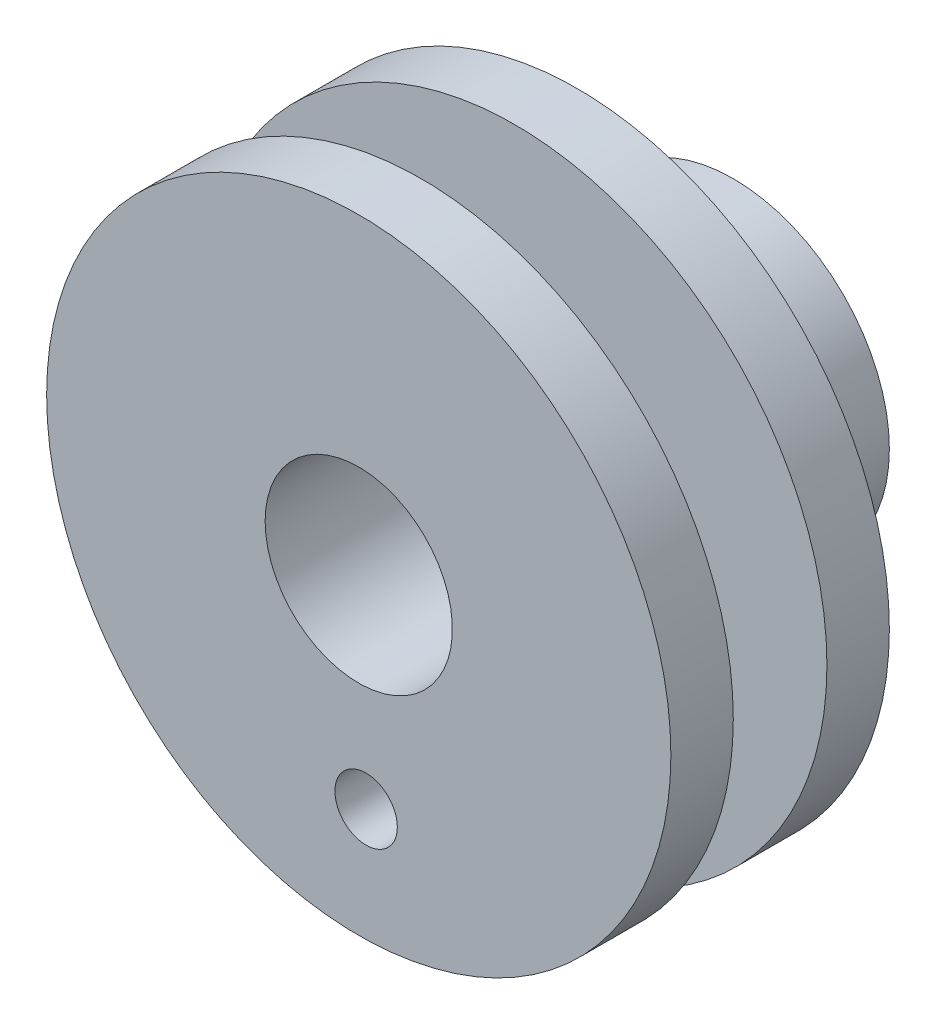
ISO-10303-21;
HEADER;
FILE_DESCRIPTION(('STEP AP214'),'2;1');
FILE_NAME('part.step','',(''),(''),'','','');
FILE_SCHEMA(('AUTOMOTIVE_DESIGN { 1 0 10303 214 1 1 1 1 }'));
ENDSEC;
DATA;
#1=APPLICATION_CONTEXT('core data for automotive mechanical design processes');
#2=APPLICATION_PROTOCOL_DEFINITION('international standard','automotive_design',2000,#1);
#3=PRODUCT_CONTEXT('',#1,'mechanical');
#4=PRODUCT('Part','Part','',(#3));
#5=PRODUCT_RELATED_PRODUCT_CATEGORY('part','',(#4));
#6=PRODUCT_DEFINITION_FORMATION('','',#4);
#7=PRODUCT_DEFINITION_CONTEXT('part definition',#1,'design');
#8=PRODUCT_DEFINITION('design','',#6,#7);
#9=PRODUCT_DEFINITION_SHAPE('','',#8);
#10=(LENGTH_UNIT() NAMED_UNIT(*) SI_UNIT(.MILLI.,.METRE.));
#11=(NAMED_UNIT(*) PLANE_ANGLE_UNIT() SI_UNIT($,.RADIAN.));
#12=(NAMED_UNIT(*) SI_UNIT($,.STERADIAN.) SOLID_ANGLE_UNIT());
#13=UNCERTAINTY_MEASURE_WITH_UNIT(LENGTH_MEASURE(1.E-05),#10,'distance_accuracy_value','');
#14=(GEOMETRIC_REPRESENTATION_CONTEXT(3) GLOBAL_UNCERTAINTY_ASSIGNED_CONTEXT((#13)) GLOBAL_UNIT_ASSIGNED_CONTEXT((#10,
#11,#12)) REPRESENTATION_CONTEXT('',''));
#15=CARTESIAN_POINT('',(0.,0.,0.));
#16=DIRECTION('',(0.,0.,1.));
#17=DIRECTION('',(1.,0.,0.));
#18=AXIS2_PLACEMENT_3D('',#15,#16,#17);
#19=CARTESIAN_POINT('',(0.,0.,0.));
#20=DIRECTION('',(0.,0.,1.));
#21=DIRECTION('',(1.,0.,0.));
#22=AXIS2_PLACEMENT_3D('',#19,#20,#21);
#23=PLANE('',#22);
#24=CARTESIAN_POINT('',(0.,0.,0.));
#25=DIRECTION('',(0.,0.,1.));
#26=DIRECTION('',(1.,0.,0.));
#27=AXIS2_PLACEMENT_3D('',#24,#25,#26);
#28=CIRCLE('',#27,5.);
#29=CARTESIAN_POINT('',(5.,0.,0.));
#30=VERTEX_POINT('',#29);
#31=EDGE_CURVE('E44',#30,#30,#28,.T.);
#32=ORIENTED_EDGE('',*,*,#31,.F.);
#33=EDGE_LOOP('',(#32));
#34=FACE_BOUND('',#33,.T.);
#35=CARTESIAN_POINT('',(0.,0.,0.));
#36=DIRECTION('',(0.,0.,1.));
#37=DIRECTION('',(1.,0.,0.));
#38=AXIS2_PLACEMENT_3D('',#35,#36,#37);
#39=CIRCLE('',#38,3.);
#40=CARTESIAN_POINT('',(3.,0.,0.));
#41=VERTEX_POINT('',#40);
#42=EDGE_CURVE('E49',#41,#41,#39,.T.);
#43=ORIENTED_EDGE('',*,*,#42,.T.);
#44=EDGE_LOOP('',(#43));
#45=FACE_BOUND('',#44,.T.);
#46=ADVANCED_FACE('F35',(#34,#45),#23,.F.);
#47=CARTESIAN_POINT('',(0.,0.,5.));
#48=DIRECTION('',(0.,0.,-1.));
#49=DIRECTION('',(-1.,0.,0.));
#50=AXIS2_PLACEMENT_3D('',#47,#48,#49);
#51=CYLINDRICAL_SURFACE('',#50,5.);
#52=CARTESIAN_POINT('',(1.49167878903844,-4.77230493475981,2.14391534473121));
#53=CARTESIAN_POINT('',(1.49167689702003,-4.77230634928233,2.0748899692689));
#54=CARTESIAN_POINT('',(1.48602414465484,-4.77408365845577,2.00584289539221));
#55=CARTESIAN_POINT('',(1.46359214324519,-4.78100732743095,1.86973155564419));
#56=CARTESIAN_POINT('',(1.44680641865099,-4.7861556479763,1.80266846749705));
#57=CARTESIAN_POINT('',(1.40266716991747,-4.79927602091638,1.67251357563769));
#58=CARTESIAN_POINT('',(1.37532728809784,-4.80724442696224,1.60941676703837));
#59=CARTESIAN_POINT('',(1.31086972752744,-4.82521868449436,1.48875991846125));
#60=CARTESIAN_POINT('',(1.27375163365594,-4.83522462247718,1.4312001136911));
#61=CARTESIAN_POINT('',(1.18988485361615,-4.85655002347249,1.32198452210011));
#62=CARTESIAN_POINT('',(1.14295969064206,-4.8678916100804,1.27046854455619));
#63=CARTESIAN_POINT('',(1.04114859757223,-4.89067749535809,1.17603464755104));
#64=CARTESIAN_POINT('',(0.986261924052269,-4.90212180352601,1.13311753192034));
#65=CARTESIAN_POINT('',(0.86909988669708,-4.92425255712707,1.05652761091557));
#66=CARTESIAN_POINT('',(0.806732111969398,-4.93492619965248,1.02299215065048));
#67=CARTESIAN_POINT('',(0.676930882811401,-4.95439855590894,0.967010522654672));
#68=CARTESIAN_POINT('',(0.609498177480725,-4.96319754616409,0.944562718773456));
#69=CARTESIAN_POINT('',(0.472909352860754,-4.97804965819187,0.911841427441921));
#70=CARTESIAN_POINT('',(0.403815820916356,-4.98415479528959,0.901330522567923));
#71=CARTESIAN_POINT('',(0.264656522202342,-4.99347742520208,0.892036155093437));
#72=CARTESIAN_POINT('',(0.194590900704426,-4.99669534486935,0.893250958626414));
#73=CARTESIAN_POINT('',(0.0571242382784611,-5.00013623795704,0.907202769856286));
#74=CARTESIAN_POINT('',(-0.0103014298681106,-5.00042408336881,0.919683507258142));
#75=CARTESIAN_POINT('',(-0.142196625302667,-4.99841306622039,0.955400979755463));
#76=CARTESIAN_POINT('',(-0.206665995026979,-4.99611406595386,0.978638287419918));
#77=CARTESIAN_POINT('',(-0.331474384505906,-4.98939570164436,1.03541663007475));
#78=CARTESIAN_POINT('',(-0.391770821311243,-4.98495736679415,1.06904886706209));
#79=CARTESIAN_POINT('',(-0.506021467415015,-4.97465954395289,1.14559318428934));
#80=CARTESIAN_POINT('',(-0.559974570785725,-4.96879980869184,1.18850687901152));
#81=CARTESIAN_POINT('',(-0.661512486549662,-4.9563183996494,1.2837697157224));
#82=CARTESIAN_POINT('',(-0.708885422728341,-4.94968039648488,1.3363427909051));
#83=CARTESIAN_POINT('',(-0.794167952806289,-4.93671584037692,1.44871533150134));
#84=CARTESIAN_POINT('',(-0.832077104396616,-4.93038930200152,1.50851513447671));
#85=CARTESIAN_POINT('',(-0.897457778463843,-4.91891063079233,1.63406036180569));
#86=CARTESIAN_POINT('',(-0.924877798591494,-4.9137643412839,1.69983320988781));
#87=CARTESIAN_POINT('',(-0.968096049289099,-4.9054336923531,1.83520807876944));
#88=CARTESIAN_POINT('',(-0.983896766843379,-4.90224891311469,1.90480927672278));
#89=CARTESIAN_POINT('',(-1.00305318962098,-4.8983648378151,2.04389509549277));
#90=CARTESIAN_POINT('',(-1.00672657194741,-4.89760211647129,2.11333424139602));
#91=CARTESIAN_POINT('',(-1.00238965822174,-4.8984915946074,2.25182631302029));
#92=CARTESIAN_POINT('',(-0.994380437694156,-4.90014357178523,2.32087927370683));
#93=CARTESIAN_POINT('',(-0.967193227169785,-4.90558072295166,2.45547247720856));
#94=CARTESIAN_POINT('',(-0.948200119472121,-4.90933055232822,2.52105170801663));
#95=CARTESIAN_POINT('',(-0.899808815165707,-4.91842926272917,2.64813107365705));
#96=CARTESIAN_POINT('',(-0.870409385981234,-4.92377833316385,2.70963072425887));
#97=CARTESIAN_POINT('',(-0.801403886909326,-4.93548333614744,2.82813598366488));
#98=CARTESIAN_POINT('',(-0.761608905212399,-4.94185696200594,2.88502976475275));
#99=CARTESIAN_POINT('',(-0.673217855554666,-4.95467132655259,2.99150952613188));
#100=CARTESIAN_POINT('',(-0.624620341258954,-4.96111207610561,3.04109430305624));
#101=CARTESIAN_POINT('',(-0.518588181440236,-4.97332679760415,3.13282086601668));
#102=CARTESIAN_POINT('',(-0.460962845002641,-4.97908005363381,3.17474537600561));
#103=CARTESIAN_POINT('',(-0.339382225660624,-4.9888408815225,3.24838327820682));
#104=CARTESIAN_POINT('',(-0.275427273156459,-4.99284854444099,3.2800972030353));
#105=CARTESIAN_POINT('',(-0.143475163510295,-4.99837365535276,3.33213836199517));
#106=CARTESIAN_POINT('',(-0.0755111313816414,-4.9999091703039,3.35254748692073));
#107=CARTESIAN_POINT('',(0.0628819375382873,-5.00008285499552,3.38164551203541));
#108=CARTESIAN_POINT('',(0.133310495917419,-4.99872158402299,3.39033667410073));
#109=CARTESIAN_POINT('',(0.272584438206461,-4.99303766191703,3.39562483170062));
#110=CARTESIAN_POINT('',(0.341421139895626,-4.9887960771768,3.39254248110044));
#111=CARTESIAN_POINT('',(0.477423567921002,-4.97762220346026,3.37510556061329));
#112=CARTESIAN_POINT('',(0.544589343891134,-4.97068999450925,3.36075132596482));
#113=CARTESIAN_POINT('',(0.675023740793093,-4.95465856376347,3.32135007001754));
#114=CARTESIAN_POINT('',(0.738311395086077,-4.94557120873107,3.29636102808792));
#115=CARTESIAN_POINT('',(0.859745255100065,-4.92591373250152,3.23645212095704));
#116=CARTESIAN_POINT('',(0.917890811487363,-4.91534342447474,3.20153100389424));
#117=CARTESIAN_POINT('',(1.02892737487265,-4.89332115933659,3.12177130223486));
#118=CARTESIAN_POINT('',(1.08165912540563,-4.88185414719778,3.07671516609698));
#119=CARTESIAN_POINT('',(1.17892293339561,-4.85928381293484,2.97838677976395));
#120=CARTESIAN_POINT('',(1.22345290877097,-4.8481805837462,2.92511244960882));
#121=CARTESIAN_POINT('',(1.30390112598863,-4.82717379434891,2.81066357697954));
#122=CARTESIAN_POINT('',(1.33964320950543,-4.81729647949772,2.74936019046542));
#123=CARTESIAN_POINT('',(1.40036358367896,-4.79999850349553,2.62134598232783));
#124=CARTESIAN_POINT('',(1.42534970564203,-4.79257605589608,2.55463913709778));
#125=CARTESIAN_POINT('',(1.46015783867623,-4.78207078392782,2.43069407994781));
#126=CARTESIAN_POINT('',(1.47195324942532,-4.77843293162581,2.37404888925138));
#127=CARTESIAN_POINT('',(1.48771418335974,-4.77354951642787,2.25957925848125));
#128=CARTESIAN_POINT('',(1.49168037444873,-4.77230374946555,2.20175491942488));
#129=CARTESIAN_POINT('',(1.49167878903844,-4.77230493475981,2.14391534473121));
#130=B_SPLINE_CURVE_WITH_KNOTS('',3,(#52,#53,#54,#55,#56,#57,#58,#59,#60,#61,#62,#63,#64,#65,
#66,#67,#68,#69,#70,#71,#72,#73,#74,#75,#76,#77,#78,#79,#80,#81,#82,#83,#84,#85,#86,#87,#88,#89,
#90,#91,#92,#93,#94,#95,#96,#97,#98,#99,#100,#101,#102,#103,#104,#105,#106,#107,#108,#109,#110,
#111,#112,#113,#114,#115,#116,#117,#118,#119,#120,#121,#122,#123,#124,#125,#126,#127,#128,#129),
.UNSPECIFIED.,.T.,.F.,(4,2,2,2,2,2,2,2,2,2,2,2,2,2,2,2,2,2,2,2,2,2,2,2,2,2,2,2,2,2,2,2,2,2,2,2,
2,2,4),(0.,0.206863720868067,0.413847870714331,0.620565363583007,0.827291633777388,
1.03811977096488,1.24896760739933,1.46275748198959,1.67651579923545,1.88594375497672,
2.09534074333009,2.30009131344472,2.50485278362392,2.71146437127221,2.91811192734455,
3.13035233285954,3.34260265599899,3.55588216004199,3.76911600064772,3.97671787380856,
4.18430063591899,4.38848702504601,4.59269760710706,4.80091422929576,5.00916509442519,
5.22262665482657,5.43607707859774,5.64796036403461,5.85980274454516,6.06591723063725,
6.27202558688487,6.47702438279852,6.68204902869032,6.89198548291032,7.10197515782751,
7.31588238642335,7.52963360683306,7.70298913588661,7.87632987549756),.UNSPECIFIED.);
#131=CARTESIAN_POINT('',(1.49167878903844,-4.77230493475981,2.14391534473121));
#132=VERTEX_POINT('',#131);
#133=EDGE_CURVE('E74',#132,#132,#130,.T.);
#134=ORIENTED_EDGE('',*,*,#133,.T.);
#135=EDGE_LOOP('',(#134));
#136=FACE_BOUND('',#135,.T.);
#137=CARTESIAN_POINT('',(0.,0.,5.));
#138=DIRECTION('',(0.,0.,1.));
#139=DIRECTION('',(1.,0.,0.));
#140=AXIS2_PLACEMENT_3D('',#137,#138,#139);
#141=CIRCLE('',#140,5.);
#142=CARTESIAN_POINT('',(5.,0.,5.));
#143=VERTEX_POINT('',#142);
#144=EDGE_CURVE('E10',#143,#143,#141,.T.);
#145=ORIENTED_EDGE('',*,*,#144,.F.);
#146=EDGE_LOOP('',(#145));
#147=FACE_BOUND('',#146,.T.);
#148=ORIENTED_EDGE('',*,*,#31,.T.);
#149=EDGE_LOOP('',(#148));
#150=FACE_BOUND('',#149,.T.);
#151=ADVANCED_FACE('F37',(#136,#147,#150),#51,.T.);
#152=CARTESIAN_POINT('',(0.,0.,5.));
#153=DIRECTION('',(0.,0.,-1.));
#154=DIRECTION('',(-1.,0.,0.));
#155=AXIS2_PLACEMENT_3D('',#152,#153,#154);
#156=CYLINDRICAL_SURFACE('',#155,3.);
#157=CARTESIAN_POINT('',(1.38545383099857,-2.66092421578883,2.14391534473121));
#158=CARTESIAN_POINT('',(1.38544679114328,-2.66093174600651,2.07724345383435));
#159=CARTESIAN_POINT('',(1.38021729183885,-2.66367137359121,2.01046268790499));
#160=CARTESIAN_POINT('',(1.3594902208194,-2.67430602366312,1.87882840267407));
#161=CARTESIAN_POINT('',(1.34396476533493,-2.68221504519329,1.81398061805597));
#162=CARTESIAN_POINT('',(1.30332367199318,-2.70219429759885,1.68835421504013));
#163=CARTESIAN_POINT('',(1.27824712675196,-2.71424754683967,1.62756018101619));
#164=CARTESIAN_POINT('',(1.21928587266197,-2.7412385840525,1.51115589515316));
#165=CARTESIAN_POINT('',(1.18540324740859,-2.75617568946427,1.45554442129809));
#166=CARTESIAN_POINT('',(1.10748348781613,-2.78843208523749,1.34758961975774));
#167=CARTESIAN_POINT('',(1.06298123757245,-2.80583823640156,1.29560778598712));
#168=CARTESIAN_POINT('',(0.965978526329279,-2.84069364388933,1.19971512223366));
#169=CARTESIAN_POINT('',(0.913474995731533,-2.85814291421687,1.1558074041182));
#170=CARTESIAN_POINT('',(0.799100323430222,-2.89225634984006,1.07546581385193));
#171=CARTESIAN_POINT('',(0.73692164578405,-2.90885363447924,1.03943871669886));
#172=CARTESIAN_POINT('',(0.606564394243463,-2.93879933656774,0.978639324225608));
#173=CARTESIAN_POINT('',(0.538388499856499,-2.95214919500254,0.953862032766995));
#174=CARTESIAN_POINT('',(0.401698126834175,-2.97374743052062,0.917575885974473));
#175=CARTESIAN_POINT('',(0.333385894110534,-2.98222513244724,0.905443649829167));
#176=CARTESIAN_POINT('',(0.195287724652109,-2.99443816831912,0.892777703571356));
#177=CARTESIAN_POINT('',(0.125502397185949,-2.99817542529125,0.892239288848252));
#178=CARTESIAN_POINT('',(-0.00902791885301256,-3.00069534784421,0.902449625664532));
#179=CARTESIAN_POINT('',(-0.0738211851174021,-2.99976570297799,0.91251344525694));
#180=CARTESIAN_POINT('',(-0.200899753447096,-2.99394169783605,0.942468447369375));
#181=CARTESIAN_POINT('',(-0.263184870259452,-2.98904704526498,0.962360354361377));
#182=CARTESIAN_POINT('',(-0.384594446786624,-2.97588236943789,1.01164338562585));
#183=CARTESIAN_POINT('',(-0.443656186723513,-2.96756198805153,1.04117480760204));
#184=CARTESIAN_POINT('',(-0.556259212355057,-2.94853209490002,1.10876110143155));
#185=CARTESIAN_POINT('',(-0.609798537263984,-2.93782173879235,1.1468189855762));
#186=CARTESIAN_POINT('',(-0.71380416466175,-2.91436496174055,1.23349776513583));
#187=CARTESIAN_POINT('',(-0.763787837116665,-2.90152823740883,1.28267413601022));
#188=CARTESIAN_POINT('',(-0.855002118278728,-2.87597287343849,1.38862678543779));
#189=CARTESIAN_POINT('',(-0.896229349232412,-2.86325428117125,1.4454059830233));
#190=CARTESIAN_POINT('',(-0.969968535097738,-2.83914059427698,1.56731038139312));
#191=CARTESIAN_POINT('',(-1.00214952124901,-2.82780273599979,1.63264855047449));
#192=CARTESIAN_POINT('',(-1.05467050317575,-2.80864041459464,1.76839638970571));
#193=CARTESIAN_POINT('',(-1.07501896554427,-2.80081344022296,1.83880239300075));
#194=CARTESIAN_POINT('',(-1.10198733109501,-2.79030847476632,1.97781215364521));
#195=CARTESIAN_POINT('',(-1.10941229667032,-2.78732936142461,2.04623646699026));
#196=CARTESIAN_POINT('',(-1.11267182795017,-2.7860306791078,2.18339382714271));
#197=CARTESIAN_POINT('',(-1.10851040349725,-2.78770949810486,2.25212675892292));
#198=CARTESIAN_POINT('',(-1.08946002536754,-2.79520438657093,2.38331373016165));
#199=CARTESIAN_POINT('',(-1.0752749339499,-2.80074869693281,2.44588803151801));
#200=CARTESIAN_POINT('',(-1.03753832000012,-2.81494539704105,2.56776664122908));
#201=CARTESIAN_POINT('',(-1.01398460815321,-2.82359851322584,2.62707018156191));
#202=CARTESIAN_POINT('',(-0.957111998901429,-2.84339181559625,2.74353065508767));
#203=CARTESIAN_POINT('',(-0.92342179228409,-2.85462180912228,2.80049031934153));
#204=CARTESIAN_POINT('',(-0.847658951466137,-2.87802792704141,2.90832339723022));
#205=CARTESIAN_POINT('',(-0.805582689353646,-2.89020445952353,2.95919416143307));
#206=CARTESIAN_POINT('',(-0.710263425331896,-2.91515726072067,3.05771547961521));
#207=CARTESIAN_POINT('',(-0.656390210351152,-2.92790165518948,3.10476674468186));
#208=CARTESIAN_POINT('',(-0.541238021485154,-2.95135736426589,3.18938763671053));
#209=CARTESIAN_POINT('',(-0.479958505342897,-2.96206852986159,3.2269565687949));
#210=CARTESIAN_POINT('',(-0.35135902996874,-2.98006165676206,3.29150522017478));
#211=CARTESIAN_POINT('',(-0.284024009413148,-2.98733476947777,3.31845758602068));
#212=CARTESIAN_POINT('',(-0.145438113173097,-2.9972756857411,3.36053213706563));
#213=CARTESIAN_POINT('',(-0.0741895950802496,-2.99994623126639,3.37566136295727));
#214=CARTESIAN_POINT('',(0.0648090947821733,-3.0000484909428,3.39277347025151));
#215=CARTESIAN_POINT('',(0.132455688866621,-2.99783334440976,3.39560134442816));
#216=CARTESIAN_POINT('',(0.267005383324585,-2.98885445877756,3.39030220343726));
#217=CARTESIAN_POINT('',(0.333908611963188,-2.98209151717432,3.38217710871833));
#218=CARTESIAN_POINT('',(0.462643476192199,-2.96479924912555,3.35580927257254));
#219=CARTESIAN_POINT('',(0.524570829988508,-2.95441203997156,3.33793566426165));
#220=CARTESIAN_POINT('',(0.644361339532228,-2.93061961539624,3.29298109752207));
#221=CARTESIAN_POINT('',(0.702223720723897,-2.91721382683834,3.2658983900663));
#222=CARTESIAN_POINT('',(0.815155184405698,-2.88774681780898,3.20192581551674));
#223=CARTESIAN_POINT('',(0.869979846365487,-2.87159296968466,3.16464804330721));
#224=CARTESIAN_POINT('',(0.972769971033962,-2.83842218918463,3.08190816185931));
#225=CARTESIAN_POINT('',(1.02073287547964,-2.82140493809369,3.03644301432445));
#226=CARTESIAN_POINT('',(1.11188293158216,-2.78679979041306,2.9349705188768));
#227=CARTESIAN_POINT('',(1.15452302744049,-2.76925185860817,2.87845633011008));
#228=CARTESIAN_POINT('',(1.22989383414854,-2.73661376390522,2.75845660405101));
#229=CARTESIAN_POINT('',(1.26261900564365,-2.72152497707031,2.69496719667306));
#230=CARTESIAN_POINT('',(1.31694023096859,-2.69565825023024,2.56297150970845));
#231=CARTESIAN_POINT('',(1.3385954530032,-2.68485746192737,2.49449418593799));
#232=CARTESIAN_POINT('',(1.37007259561222,-2.66893720227683,2.35437577088054));
#233=CARTESIAN_POINT('',(1.37993420739114,-2.6637986792825,2.2827461374569));
#234=CARTESIAN_POINT('',(1.38487288786228,-2.6612255558175,2.18855682046932));
#235=CARTESIAN_POINT('',(1.38545618847995,-2.66092169409666,2.16624218734317));
#236=CARTESIAN_POINT('',(1.38545383099857,-2.66092421578883,2.14391534473121));
#237=B_SPLINE_CURVE_WITH_KNOTS('',3,(#157,#158,#159,#160,#161,#162,#163,#164,#165,#166,#167,
#168,#169,#170,#171,#172,#173,#174,#175,#176,#177,#178,#179,#180,#181,#182,#183,#184,#185,#186,
#187,#188,#189,#190,#191,#192,#193,#194,#195,#196,#197,#198,#199,#200,#201,#202,#203,#204,#205,
#206,#207,#208,#209,#210,#211,#212,#213,#214,#215,#216,#217,#218,#219,#220,#221,#222,#223,#224,
#225,#226,#227,#228,#229,#230,#231,#232,#233,#234,#235,#236),.UNSPECIFIED.,.T.,.F.,(4,2,2,2,2,2,
2,2,2,2,2,2,2,2,2,2,2,2,2,2,2,2,2,2,2,2,2,2,2,2,2,2,2,2,2,2,2,2,2,4),(0.,0.199951711985514,
0.400447161842174,0.600130652152109,0.799766938550097,1.01066841430653,1.2216510045991,
1.44178476577923,1.6618206677489,1.87040605977951,2.07890680917929,2.27471840245092,
2.47054443201882,2.66935814640064,2.86824221022483,3.08114531844483,3.29413040441365,
3.5141154566672,3.73394290745567,3.93950778306306,4.14500152518447,4.3373390106619,
4.52972146913527,4.73025126818167,4.93086800795463,5.14781662735511,5.36478114041864,
5.58230105955592,5.79969134643005,6.0018863509405,6.20404590801911,6.39903415036485,
6.59405944632169,6.79789862829034,7.00181361048901,7.21960426908074,7.43751638139185,
7.65425125796861,7.87025464546159,7.93721375436702),.UNSPECIFIED.);
#238=CARTESIAN_POINT('',(1.38545383099857,-2.66092421578883,2.14391534473121));
#239=VERTEX_POINT('',#238);
#240=EDGE_CURVE('E81',#239,#239,#237,.T.);
#241=ORIENTED_EDGE('',*,*,#240,.F.);
#242=EDGE_LOOP('',(#241));
#243=FACE_BOUND('',#242,.T.);
#244=ORIENTED_EDGE('',*,*,#42,.F.);
#245=EDGE_LOOP('',(#244));
#246=FACE_BOUND('',#245,.T.);
#247=CARTESIAN_POINT('',(0.,0.,12.));
#248=DIRECTION('',(0.,0.,-1.));
#249=DIRECTION('',(-1.,0.,0.));
#250=AXIS2_PLACEMENT_3D('',#247,#248,#249);
#251=CIRCLE('',#250,3.);
#252=CARTESIAN_POINT('',(-3.,0.,12.));
#253=VERTEX_POINT('',#252);
#254=EDGE_CURVE('E69',#253,#253,#251,.T.);
#255=ORIENTED_EDGE('',*,*,#254,.F.);
#256=EDGE_LOOP('',(#255));
#257=FACE_BOUND('',#256,.T.);
#258=ADVANCED_FACE('F118',(#243,#246,#257),#156,.F.);
#259=CARTESIAN_POINT('',(0.,0.,7.));
#260=DIRECTION('',(0.,0.,1.));
#261=DIRECTION('',(1.,0.,0.));
#262=AXIS2_PLACEMENT_3D('',#259,#260,#261);
#263=PLANE('',#262);
#264=CARTESIAN_POINT('',(0.235884412530664,-6.37630598688876,7.));
#265=DIRECTION('',(0.,0.,1.));
#266=DIRECTION('',(1.,0.,0.));
#267=AXIS2_PLACEMENT_3D('',#264,#265,#266);
#268=CIRCLE('',#267,1.);
#269=CARTESIAN_POINT('',(1.23588441253066,-6.37630598688876,7.));
#270=VERTEX_POINT('',#269);
#271=EDGE_CURVE('E235',#270,#270,#268,.T.);
#272=ORIENTED_EDGE('',*,*,#271,.F.);
#273=EDGE_LOOP('',(#272));
#274=FACE_BOUND('',#273,.T.);
#275=CARTESIAN_POINT('',(0.,0.,7.));
#276=DIRECTION('',(0.,0.,1.));
#277=DIRECTION('',(1.,0.,0.));
#278=AXIS2_PLACEMENT_3D('',#275,#276,#277);
#279=CIRCLE('',#278,5.);
#280=CARTESIAN_POINT('',(5.,0.,7.));
#281=VERTEX_POINT('',#280);
#282=EDGE_CURVE('E60',#281,#281,#279,.T.);
#283=ORIENTED_EDGE('',*,*,#282,.F.);
#284=EDGE_LOOP('',(#283));
#285=FACE_BOUND('',#284,.T.);
#286=CARTESIAN_POINT('',(0.,0.,7.));
#287=DIRECTION('',(0.,0.,1.));
#288=DIRECTION('',(1.,0.,0.));
#289=AXIS2_PLACEMENT_3D('',#286,#287,#288);
#290=CIRCLE('',#289,10.);
#291=CARTESIAN_POINT('',(10.,0.,7.));
#292=VERTEX_POINT('',#291);
#293=EDGE_CURVE('E53',#292,#292,#290,.T.);
#294=ORIENTED_EDGE('',*,*,#293,.T.);
#295=EDGE_LOOP('',(#294));
#296=FACE_BOUND('',#295,.T.);
#297=ADVANCED_FACE('F114',(#274,#285,#296),#263,.T.);
#298=CARTESIAN_POINT('',(0.,0.,5.));
#299=DIRECTION('',(0.,0.,1.));
#300=DIRECTION('',(1.,0.,0.));
#301=AXIS2_PLACEMENT_3D('',#298,#299,#300);
#302=PLANE('',#301);
#303=CARTESIAN_POINT('',(0.235884412530664,-6.37630598688876,5.));
#304=DIRECTION('',(0.,0.,1.));
#305=DIRECTION('',(1.,0.,0.));
#306=AXIS2_PLACEMENT_3D('',#303,#304,#305);
#307=CIRCLE('',#306,1.);
#308=CARTESIAN_POINT('',(1.23588441253066,-6.37630598688876,5.));
#309=VERTEX_POINT('',#308);
#310=EDGE_CURVE('E238',#309,#309,#307,.T.);
#311=ORIENTED_EDGE('',*,*,#310,.T.);
#312=EDGE_LOOP('',(#311));
#313=FACE_BOUND('',#312,.T.);
#314=ORIENTED_EDGE('',*,*,#144,.T.);
#315=EDGE_LOOP('',(#314));
#316=FACE_BOUND('',#315,.T.);
#317=CARTESIAN_POINT('',(0.,0.,5.));
#318=DIRECTION('',(0.,0.,1.));
#319=DIRECTION('',(1.,0.,0.));
#320=AXIS2_PLACEMENT_3D('',#317,#318,#319);
#321=CIRCLE('',#320,10.);
#322=CARTESIAN_POINT('',(10.,0.,5.));
#323=VERTEX_POINT('',#322);
#324=EDGE_CURVE('E54',#323,#323,#321,.T.);
#325=ORIENTED_EDGE('',*,*,#324,.F.);
#326=EDGE_LOOP('',(#325));
#327=FACE_BOUND('',#326,.T.);
#328=ADVANCED_FACE('F117',(#313,#316,#327),#302,.F.);
#329=CARTESIAN_POINT('',(0.,0.,7.));
#330=DIRECTION('',(0.,0.,-1.));
#331=DIRECTION('',(-1.,0.,0.));
#332=AXIS2_PLACEMENT_3D('',#329,#330,#331);
#333=CYLINDRICAL_SURFACE('',#332,10.);
#334=ORIENTED_EDGE('',*,*,#293,.F.);
#335=EDGE_LOOP('',(#334));
#336=FACE_BOUND('',#335,.T.);
#337=ORIENTED_EDGE('',*,*,#324,.T.);
#338=EDGE_LOOP('',(#337));
#339=FACE_BOUND('',#338,.T.);
#340=ADVANCED_FACE('F112',(#336,#339),#333,.T.);
#341=CARTESIAN_POINT('',(0.,0.,10.));
#342=DIRECTION('',(0.,0.,-1.));
#343=DIRECTION('',(-1.,0.,0.));
#344=AXIS2_PLACEMENT_3D('',#341,#342,#343);
#345=CYLINDRICAL_SURFACE('',#344,5.);
#346=CARTESIAN_POINT('',(0.,0.,10.));
#347=DIRECTION('',(0.,0.,1.));
#348=DIRECTION('',(1.,0.,0.));
#349=AXIS2_PLACEMENT_3D('',#346,#347,#348);
#350=CIRCLE('',#349,5.);
#351=CARTESIAN_POINT('',(5.,0.,10.));
#352=VERTEX_POINT('',#351);
#353=EDGE_CURVE('E57',#352,#352,#350,.T.);
#354=ORIENTED_EDGE('',*,*,#353,.F.);
#355=EDGE_LOOP('',(#354));
#356=FACE_BOUND('',#355,.T.);
#357=ORIENTED_EDGE('',*,*,#282,.T.);
#358=EDGE_LOOP('',(#357));
#359=FACE_BOUND('',#358,.T.);
#360=ADVANCED_FACE('F108',(#356,#359),#345,.T.);
#361=CARTESIAN_POINT('',(0.,0.,12.));
#362=DIRECTION('',(0.,0.,-1.));
#363=DIRECTION('',(-1.,0.,0.));
#364=AXIS2_PLACEMENT_3D('',#361,#362,#363);
#365=CYLINDRICAL_SURFACE('',#364,10.);
#366=CARTESIAN_POINT('',(0.,0.,12.));
#367=DIRECTION('',(0.,0.,1.));
#368=DIRECTION('',(1.,0.,0.));
#369=AXIS2_PLACEMENT_3D('',#366,#367,#368);
#370=CIRCLE('',#369,10.);
#371=CARTESIAN_POINT('',(10.,0.,12.));
#372=VERTEX_POINT('',#371);
#373=EDGE_CURVE('E63',#372,#372,#370,.T.);
#374=ORIENTED_EDGE('',*,*,#373,.F.);
#375=EDGE_LOOP('',(#374));
#376=FACE_BOUND('',#375,.T.);
#377=CARTESIAN_POINT('',(0.,0.,10.));
#378=DIRECTION('',(0.,0.,1.));
#379=DIRECTION('',(1.,0.,0.));
#380=AXIS2_PLACEMENT_3D('',#377,#378,#379);
#381=CIRCLE('',#380,10.);
#382=CARTESIAN_POINT('',(10.,0.,10.));
#383=VERTEX_POINT('',#382);
#384=EDGE_CURVE('E66',#383,#383,#381,.T.);
#385=ORIENTED_EDGE('',*,*,#384,.T.);
#386=EDGE_LOOP('',(#385));
#387=FACE_BOUND('',#386,.T.);
#388=ADVANCED_FACE('F101',(#376,#387),#365,.T.);
#389=CARTESIAN_POINT('',(0.,0.,12.));
#390=DIRECTION('',(0.,0.,1.));
#391=DIRECTION('',(1.,0.,0.));
#392=AXIS2_PLACEMENT_3D('',#389,#390,#391);
#393=PLANE('',#392);
#394=CARTESIAN_POINT('',(0.235884412530664,-6.37630598688876,12.));
#395=DIRECTION('',(0.,0.,1.));
#396=DIRECTION('',(1.,0.,0.));
#397=AXIS2_PLACEMENT_3D('',#394,#395,#396);
#398=CIRCLE('',#397,1.);
#399=CARTESIAN_POINT('',(1.23588441253066,-6.37630598688876,12.));
#400=VERTEX_POINT('',#399);
#401=EDGE_CURVE('E241',#400,#400,#398,.T.);
#402=ORIENTED_EDGE('',*,*,#401,.F.);
#403=EDGE_LOOP('',(#402));
#404=FACE_BOUND('',#403,.T.);
#405=ORIENTED_EDGE('',*,*,#254,.T.);
#406=EDGE_LOOP('',(#405));
#407=FACE_BOUND('',#406,.T.);
#408=ORIENTED_EDGE('',*,*,#373,.T.);
#409=EDGE_LOOP('',(#408));
#410=FACE_BOUND('',#409,.T.);
#411=ADVANCED_FACE('F98',(#404,#407,#410),#393,.T.);
#412=CARTESIAN_POINT('',(0.,0.,10.));
#413=DIRECTION('',(0.,0.,1.));
#414=DIRECTION('',(1.,0.,0.));
#415=AXIS2_PLACEMENT_3D('',#412,#413,#414);
#416=PLANE('',#415);
#417=CARTESIAN_POINT('',(0.235884412530664,-6.37630598688876,10.));
#418=DIRECTION('',(0.,0.,1.));
#419=DIRECTION('',(1.,0.,0.));
#420=AXIS2_PLACEMENT_3D('',#417,#418,#419);
#421=CIRCLE('',#420,1.);
#422=CARTESIAN_POINT('',(1.23588441253066,-6.37630598688876,10.));
#423=VERTEX_POINT('',#422);
#424=EDGE_CURVE('E40',#423,#423,#421,.T.);
#425=ORIENTED_EDGE('',*,*,#424,.T.);
#426=EDGE_LOOP('',(#425));
#427=FACE_BOUND('',#426,.T.);
#428=ORIENTED_EDGE('',*,*,#353,.T.);
#429=EDGE_LOOP('',(#428));
#430=FACE_BOUND('',#429,.T.);
#431=ORIENTED_EDGE('',*,*,#384,.F.);
#432=EDGE_LOOP('',(#431));
#433=FACE_BOUND('',#432,.T.);
#434=ADVANCED_FACE('F92',(#427,#430,#433),#416,.F.);
#435=CARTESIAN_POINT('',(0.251235543269238,-4.99368408109666,2.14391534473121));
#436=DIRECTION('',(0.0502471086538475,-0.998736816219332,0.));
#437=DIRECTION('',(0.998736816219333,0.0502471086538475,0.));
#438=AXIS2_PLACEMENT_3D('',#435,#436,#437);
#439=CYLINDRICAL_SURFACE('',#438,1.24999999999999);
#440=ORIENTED_EDGE('',*,*,#240,.T.);
#441=EDGE_LOOP('',(#440));
#442=FACE_BOUND('',#441,.T.);
#443=ORIENTED_EDGE('',*,*,#133,.F.);
#444=EDGE_LOOP('',(#443));
#445=FACE_BOUND('',#444,.T.);
#446=ADVANCED_FACE('F87',(#442,#445),#439,.F.);
#447=CARTESIAN_POINT('',(0.235884412530664,-6.37630598688876,0.));
#448=DIRECTION('',(0.,0.,1.));
#449=DIRECTION('',(1.,0.,0.));
#450=AXIS2_PLACEMENT_3D('',#447,#448,#449);
#451=CYLINDRICAL_SURFACE('',#450,1.);
#452=ORIENTED_EDGE('',*,*,#401,.T.);
#453=EDGE_LOOP('',(#452));
#454=FACE_BOUND('',#453,.T.);
#455=ORIENTED_EDGE('',*,*,#424,.F.);
#456=EDGE_LOOP('',(#455));
#457=FACE_BOUND('',#456,.T.);
#458=ADVANCED_FACE('F91',(#454,#457),#451,.F.);
#459=ORIENTED_EDGE('',*,*,#271,.T.);
#460=EDGE_LOOP('',(#459));
#461=FACE_BOUND('',#460,.T.);
#462=ORIENTED_EDGE('',*,*,#310,.F.);
#463=EDGE_LOOP('',(#462));
#464=FACE_BOUND('',#463,.T.);
#465=ADVANCED_FACE('F94',(#461,#464),#451,.F.);
#466=CLOSED_SHELL('',(#46,#151,#258,#297,#328,#340,#360,#388,#411,#434,#446,#458,#465));
#467=MANIFOLD_SOLID_BREP('B2',#466);
#468=ADVANCED_BREP_SHAPE_REPRESENTATION('',(#18,#467),#14);
#469=SHAPE_DEFINITION_REPRESENTATION(#9,#468);
ENDSEC;
END-ISO-10303-21;
